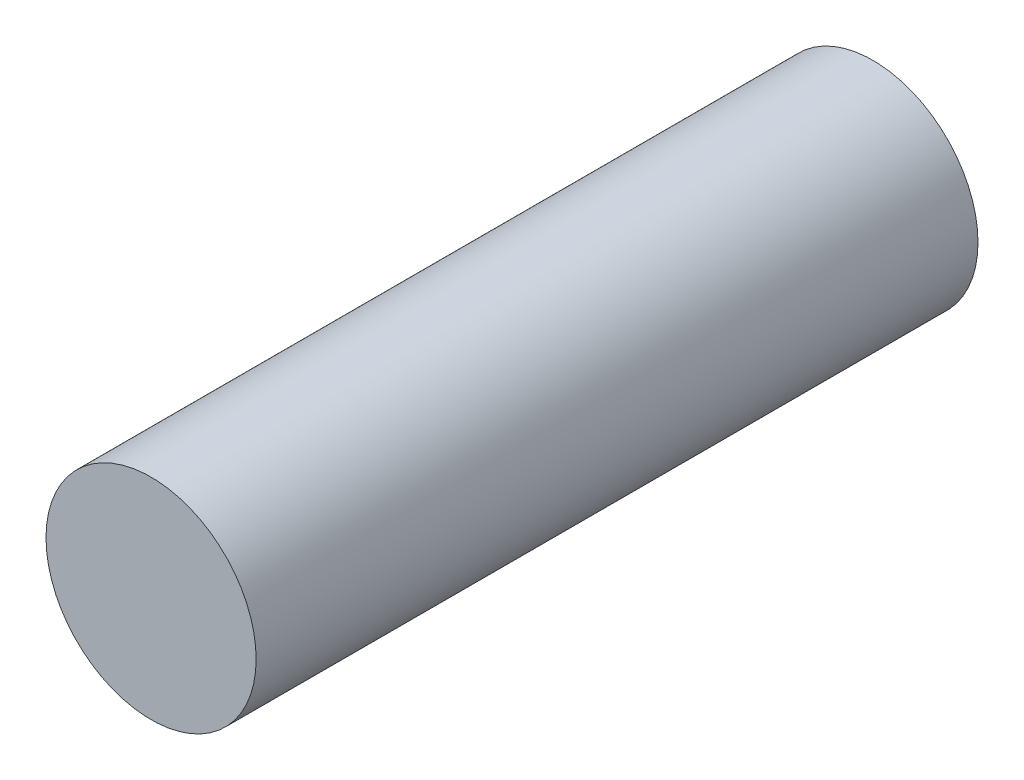
ISO-10303-21;
HEADER;
FILE_DESCRIPTION(('STEP AP214'),'2;1');
FILE_NAME('part.step','',(''),(''),'','','');
FILE_SCHEMA(('AUTOMOTIVE_DESIGN { 1 0 10303 214 1 1 1 1 }'));
ENDSEC;
DATA;
#1=APPLICATION_CONTEXT('core data for automotive mechanical design processes');
#2=APPLICATION_PROTOCOL_DEFINITION('international standard','automotive_design',2000,#1);
#3=PRODUCT_CONTEXT('',#1,'mechanical');
#4=PRODUCT('Part','Part','',(#3));
#5=PRODUCT_RELATED_PRODUCT_CATEGORY('part','',(#4));
#6=PRODUCT_DEFINITION_FORMATION('','',#4);
#7=PRODUCT_DEFINITION_CONTEXT('part definition',#1,'design');
#8=PRODUCT_DEFINITION('design','',#6,#7);
#9=PRODUCT_DEFINITION_SHAPE('','',#8);
#10=(LENGTH_UNIT() NAMED_UNIT(*) SI_UNIT(.MILLI.,.METRE.));
#11=(NAMED_UNIT(*) PLANE_ANGLE_UNIT() SI_UNIT($,.RADIAN.));
#12=(NAMED_UNIT(*) SI_UNIT($,.STERADIAN.) SOLID_ANGLE_UNIT());
#13=UNCERTAINTY_MEASURE_WITH_UNIT(LENGTH_MEASURE(1.E-05),#10,'distance_accuracy_value','');
#14=(GEOMETRIC_REPRESENTATION_CONTEXT(3) GLOBAL_UNCERTAINTY_ASSIGNED_CONTEXT((#13)) GLOBAL_UNIT_ASSIGNED_CONTEXT((#10,
#11,#12)) REPRESENTATION_CONTEXT('',''));
#15=CARTESIAN_POINT('',(0.,0.,0.));
#16=DIRECTION('',(0.,0.,1.));
#17=DIRECTION('',(1.,0.,0.));
#18=AXIS2_PLACEMENT_3D('',#15,#16,#17);
#19=CARTESIAN_POINT('',(0.,0.,24.2460678118655));
#20=DIRECTION('',(0.,0.,-1.));
#21=DIRECTION('',(-1.,0.,0.));
#22=AXIS2_PLACEMENT_3D('',#19,#20,#21);
#23=CYLINDRICAL_SURFACE('',#22,2.5);
#24=CARTESIAN_POINT('',(0.,0.,0.));
#25=DIRECTION('',(0.,0.,1.));
#26=DIRECTION('',(1.,0.,0.));
#27=AXIS2_PLACEMENT_3D('',#24,#25,#26);
#28=CIRCLE('',#27,2.5);
#29=CARTESIAN_POINT('',(2.5,0.,0.));
#30=VERTEX_POINT('',#29);
#31=EDGE_CURVE('E46',#30,#30,#28,.T.);
#32=ORIENTED_EDGE('',*,*,#31,.T.);
#33=EDGE_LOOP('',(#32));
#34=FACE_BOUND('',#33,.T.);
#35=CARTESIAN_POINT('',(0.,0.,17.175));
#36=DIRECTION('',(0.,0.,1.));
#37=DIRECTION('',(1.,0.,0.));
#38=AXIS2_PLACEMENT_3D('',#35,#36,#37);
#39=CIRCLE('',#38,2.5);
#40=CARTESIAN_POINT('',(2.5,0.,17.175));
#41=VERTEX_POINT('',#40);
#42=EDGE_CURVE('E10',#41,#41,#39,.T.);
#43=ORIENTED_EDGE('',*,*,#42,.F.);
#44=EDGE_LOOP('',(#43));
#45=FACE_BOUND('',#44,.T.);
#46=ADVANCED_FACE('F39',(#34,#45),#23,.T.);
#47=CARTESIAN_POINT('',(0.,0.,0.));
#48=DIRECTION('',(0.,0.,1.));
#49=DIRECTION('',(1.,0.,0.));
#50=AXIS2_PLACEMENT_3D('',#47,#48,#49);
#51=PLANE('',#50);
#52=ORIENTED_EDGE('',*,*,#31,.F.);
#53=EDGE_LOOP('',(#52));
#54=FACE_BOUND('',#53,.T.);
#55=ADVANCED_FACE('F54',(#54),#51,.F.);
#56=CARTESIAN_POINT('',(-10.0294837572123,3.45100790550082,17.175));
#57=DIRECTION('',(0.,0.,1.));
#58=DIRECTION('',(-0.438565056780737,0.898699444180817,0.));
#59=AXIS2_PLACEMENT_3D('',#56,#57,#58);
#60=PLANE('',#59);
#61=ORIENTED_EDGE('',*,*,#42,.T.);
#62=EDGE_LOOP('',(#61));
#63=FACE_BOUND('',#62,.T.);
#64=ADVANCED_FACE('F41',(#63),#60,.T.);
#65=CLOSED_SHELL('',(#46,#55,#64));
#66=MANIFOLD_SOLID_BREP('B2',#65);
#67=ADVANCED_BREP_SHAPE_REPRESENTATION('',(#18,#66),#14);
#68=SHAPE_DEFINITION_REPRESENTATION(#9,#67);
ENDSEC;
END-ISO-10303-21;
